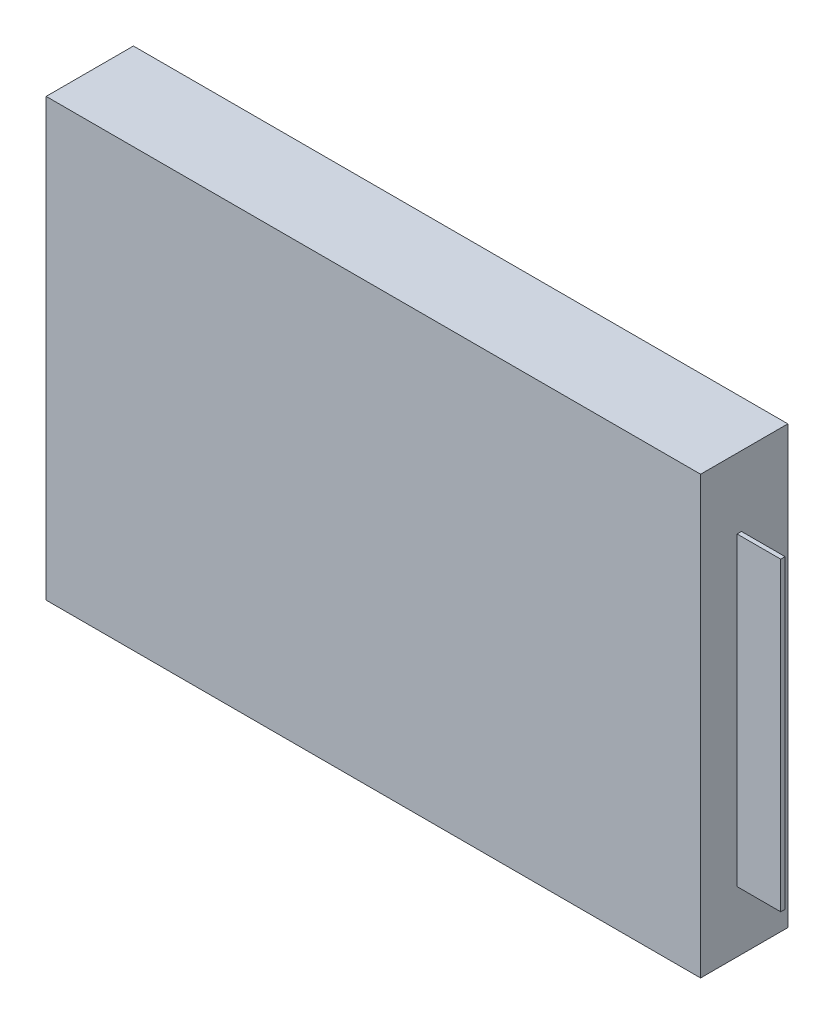
ISO-10303-21;
HEADER;
FILE_DESCRIPTION(('STEP AP214'),'2;1');
FILE_NAME('part.step','',(''),(''),'','','');
FILE_SCHEMA(('AUTOMOTIVE_DESIGN { 1 0 10303 214 1 1 1 1 }'));
ENDSEC;
DATA;
#1=APPLICATION_CONTEXT('core data for automotive mechanical design processes');
#2=APPLICATION_PROTOCOL_DEFINITION('international standard','automotive_design',2000,#1);
#3=PRODUCT_CONTEXT('',#1,'mechanical');
#4=PRODUCT('Part','Part','',(#3));
#5=PRODUCT_RELATED_PRODUCT_CATEGORY('part','',(#4));
#6=PRODUCT_DEFINITION_FORMATION('','',#4);
#7=PRODUCT_DEFINITION_CONTEXT('part definition',#1,'design');
#8=PRODUCT_DEFINITION('design','',#6,#7);
#9=PRODUCT_DEFINITION_SHAPE('','',#8);
#10=(LENGTH_UNIT() NAMED_UNIT(*) SI_UNIT(.MILLI.,.METRE.));
#11=(NAMED_UNIT(*) PLANE_ANGLE_UNIT() SI_UNIT($,.RADIAN.));
#12=(NAMED_UNIT(*) SI_UNIT($,.STERADIAN.) SOLID_ANGLE_UNIT());
#13=UNCERTAINTY_MEASURE_WITH_UNIT(LENGTH_MEASURE(1.E-05),#10,'distance_accuracy_value','');
#14=(GEOMETRIC_REPRESENTATION_CONTEXT(3) GLOBAL_UNCERTAINTY_ASSIGNED_CONTEXT((#13)) GLOBAL_UNIT_ASSIGNED_CONTEXT((#10,
#11,#12)) REPRESENTATION_CONTEXT('',''));
#15=CARTESIAN_POINT('',(0.,0.,0.));
#16=DIRECTION('',(0.,0.,1.));
#17=DIRECTION('',(1.,0.,0.));
#18=AXIS2_PLACEMENT_3D('',#15,#16,#17);
#19=CARTESIAN_POINT('',(15.,-10.,4.));
#20=DIRECTION('',(-1.,0.,0.));
#21=DIRECTION('',(0.,0.,1.));
#22=AXIS2_PLACEMENT_3D('',#19,#20,#21);
#23=PLANE('',#22);
#24=DIRECTION('',(0.,1.,0.));
#25=VECTOR('',#24,1.);
#26=CARTESIAN_POINT('',(15.,-10.,0.));
#27=LINE('',#26,#25);
#28=CARTESIAN_POINT('',(15.,-10.,0.));
#29=VERTEX_POINT('',#28);
#30=CARTESIAN_POINT('',(15.,10.,0.));
#31=VERTEX_POINT('',#30);
#32=EDGE_CURVE('E131',#29,#31,#27,.T.);
#33=ORIENTED_EDGE('',*,*,#32,.T.);
#34=DIRECTION('',(0.,0.,-1.));
#35=VECTOR('',#34,1.);
#36=CARTESIAN_POINT('',(15.,10.,4.));
#37=LINE('',#36,#35);
#38=CARTESIAN_POINT('',(15.,10.,4.));
#39=VERTEX_POINT('',#38);
#40=EDGE_CURVE('E11',#39,#31,#37,.T.);
#41=ORIENTED_EDGE('',*,*,#40,.F.);
#42=DIRECTION('',(0.,1.,0.));
#43=VECTOR('',#42,1.);
#44=CARTESIAN_POINT('',(15.,-10.,4.));
#45=LINE('',#44,#43);
#46=CARTESIAN_POINT('',(15.,-10.,4.));
#47=VERTEX_POINT('',#46);
#48=EDGE_CURVE('E140',#47,#39,#45,.T.);
#49=ORIENTED_EDGE('',*,*,#48,.F.);
#50=DIRECTION('',(0.,0.,-1.));
#51=VECTOR('',#50,1.);
#52=CARTESIAN_POINT('',(15.,-10.,4.));
#53=LINE('',#52,#51);
#54=EDGE_CURVE('E145',#47,#29,#53,.T.);
#55=ORIENTED_EDGE('',*,*,#54,.T.);
#56=EDGE_LOOP('',(#33,#41,#49,#55));
#57=FACE_BOUND('',#56,.T.);
#58=DIRECTION('',(0.,0.,-1.));
#59=VECTOR('',#58,1.);
#60=CARTESIAN_POINT('',(15.,-7.20985203650736,2.32541441581846));
#61=LINE('',#60,#59);
#62=CARTESIAN_POINT('',(15.,-7.20985203650736,2.32541441581846));
#63=VERTEX_POINT('',#62);
#64=CARTESIAN_POINT('',(15.,-7.20985203650736,2.12541441581846));
#65=VERTEX_POINT('',#64);
#66=EDGE_CURVE('E129',#63,#65,#61,.T.);
#67=ORIENTED_EDGE('',*,*,#66,.F.);
#68=DIRECTION('',(0.,1.,0.));
#69=VECTOR('',#68,1.);
#70=CARTESIAN_POINT('',(15.,-7.20985203650736,2.32541441581846));
#71=LINE('',#70,#69);
#72=CARTESIAN_POINT('',(15.,6.79014796349264,2.32541441581846));
#73=VERTEX_POINT('',#72);
#74=EDGE_CURVE('E125',#63,#73,#71,.T.);
#75=ORIENTED_EDGE('',*,*,#74,.T.);
#76=DIRECTION('',(0.,0.,-1.));
#77=VECTOR('',#76,1.);
#78=CARTESIAN_POINT('',(15.,6.79014796349264,2.32541441581846));
#79=LINE('',#78,#77);
#80=CARTESIAN_POINT('',(15.,6.79014796349264,2.12541441581846));
#81=VERTEX_POINT('',#80);
#82=EDGE_CURVE('E47',#73,#81,#79,.T.);
#83=ORIENTED_EDGE('',*,*,#82,.T.);
#84=DIRECTION('',(0.,1.,0.));
#85=VECTOR('',#84,1.);
#86=CARTESIAN_POINT('',(15.,-7.20985203650736,2.12541441581846));
#87=LINE('',#86,#85);
#88=EDGE_CURVE('E260',#65,#81,#87,.T.);
#89=ORIENTED_EDGE('',*,*,#88,.F.);
#90=EDGE_LOOP('',(#67,#75,#83,#89));
#91=FACE_BOUND('',#90,.T.);
#92=ADVANCED_FACE('F33',(#57,#91),#23,.F.);
#93=CARTESIAN_POINT('',(-15.,10.,4.));
#94=DIRECTION('',(0.,-1.,0.));
#95=DIRECTION('',(0.,0.,-1.));
#96=AXIS2_PLACEMENT_3D('',#93,#94,#95);
#97=PLANE('',#96);
#98=DIRECTION('',(-1.,0.,0.));
#99=VECTOR('',#98,1.);
#100=CARTESIAN_POINT('',(-15.,10.,0.));
#101=LINE('',#100,#99);
#102=CARTESIAN_POINT('',(-15.,10.,0.));
#103=VERTEX_POINT('',#102);
#104=EDGE_CURVE('E134',#31,#103,#101,.T.);
#105=ORIENTED_EDGE('',*,*,#104,.T.);
#106=DIRECTION('',(0.,0.,-1.));
#107=VECTOR('',#106,1.);
#108=CARTESIAN_POINT('',(-15.,10.,4.));
#109=LINE('',#108,#107);
#110=CARTESIAN_POINT('',(-15.,10.,4.));
#111=VERTEX_POINT('',#110);
#112=EDGE_CURVE('E40',#111,#103,#109,.T.);
#113=ORIENTED_EDGE('',*,*,#112,.F.);
#114=DIRECTION('',(-1.,0.,0.));
#115=VECTOR('',#114,1.);
#116=CARTESIAN_POINT('',(-15.,10.,4.));
#117=LINE('',#116,#115);
#118=EDGE_CURVE('E84',#39,#111,#117,.T.);
#119=ORIENTED_EDGE('',*,*,#118,.F.);
#120=ORIENTED_EDGE('',*,*,#40,.T.);
#121=EDGE_LOOP('',(#105,#113,#119,#120));
#122=FACE_BOUND('',#121,.T.);
#123=ADVANCED_FACE('F175',(#122),#97,.F.);
#124=CARTESIAN_POINT('',(-15.,-10.,4.));
#125=DIRECTION('',(1.,0.,0.));
#126=DIRECTION('',(0.,0.,-1.));
#127=AXIS2_PLACEMENT_3D('',#124,#125,#126);
#128=PLANE('',#127);
#129=DIRECTION('',(0.,-1.,0.));
#130=VECTOR('',#129,1.);
#131=CARTESIAN_POINT('',(-15.,-10.,0.));
#132=LINE('',#131,#130);
#133=CARTESIAN_POINT('',(-15.,-10.,0.));
#134=VERTEX_POINT('',#133);
#135=EDGE_CURVE('E148',#103,#134,#132,.T.);
#136=ORIENTED_EDGE('',*,*,#135,.T.);
#137=DIRECTION('',(0.,0.,-1.));
#138=VECTOR('',#137,1.);
#139=CARTESIAN_POINT('',(-15.,-10.,4.));
#140=LINE('',#139,#138);
#141=CARTESIAN_POINT('',(-15.,-10.,4.));
#142=VERTEX_POINT('',#141);
#143=EDGE_CURVE('E152',#142,#134,#140,.T.);
#144=ORIENTED_EDGE('',*,*,#143,.F.);
#145=DIRECTION('',(0.,-1.,0.));
#146=VECTOR('',#145,1.);
#147=CARTESIAN_POINT('',(-15.,-10.,4.));
#148=LINE('',#147,#146);
#149=EDGE_CURVE('E143',#111,#142,#148,.T.);
#150=ORIENTED_EDGE('',*,*,#149,.F.);
#151=ORIENTED_EDGE('',*,*,#112,.T.);
#152=EDGE_LOOP('',(#136,#144,#150,#151));
#153=FACE_BOUND('',#152,.T.);
#154=ADVANCED_FACE('F157',(#153),#128,.F.);
#155=CARTESIAN_POINT('',(-15.,-10.,4.));
#156=DIRECTION('',(0.,1.,0.));
#157=DIRECTION('',(0.,0.,1.));
#158=AXIS2_PLACEMENT_3D('',#155,#156,#157);
#159=PLANE('',#158);
#160=DIRECTION('',(1.,0.,0.));
#161=VECTOR('',#160,1.);
#162=CARTESIAN_POINT('',(-15.,-10.,0.));
#163=LINE('',#162,#161);
#164=EDGE_CURVE('E77',#134,#29,#163,.T.);
#165=ORIENTED_EDGE('',*,*,#164,.T.);
#166=ORIENTED_EDGE('',*,*,#54,.F.);
#167=DIRECTION('',(1.,0.,0.));
#168=VECTOR('',#167,1.);
#169=CARTESIAN_POINT('',(-15.,-10.,4.));
#170=LINE('',#169,#168);
#171=EDGE_CURVE('E56',#142,#47,#170,.T.);
#172=ORIENTED_EDGE('',*,*,#171,.F.);
#173=ORIENTED_EDGE('',*,*,#143,.T.);
#174=EDGE_LOOP('',(#165,#166,#172,#173));
#175=FACE_BOUND('',#174,.T.);
#176=ADVANCED_FACE('F166',(#175),#159,.F.);
#177=CARTESIAN_POINT('',(0.,0.,4.));
#178=DIRECTION('',(0.,0.,-1.));
#179=DIRECTION('',(-1.,0.,0.));
#180=AXIS2_PLACEMENT_3D('',#177,#178,#179);
#181=PLANE('',#180);
#182=ORIENTED_EDGE('',*,*,#48,.T.);
#183=ORIENTED_EDGE('',*,*,#118,.T.);
#184=ORIENTED_EDGE('',*,*,#149,.T.);
#185=ORIENTED_EDGE('',*,*,#171,.T.);
#186=EDGE_LOOP('',(#182,#183,#184,#185));
#187=FACE_BOUND('',#186,.T.);
#188=ADVANCED_FACE('F168',(#187),#181,.F.);
#189=CARTESIAN_POINT('',(0.,0.,0.));
#190=DIRECTION('',(0.,0.,-1.));
#191=DIRECTION('',(-1.,0.,0.));
#192=AXIS2_PLACEMENT_3D('',#189,#190,#191);
#193=PLANE('',#192);
#194=ORIENTED_EDGE('',*,*,#32,.F.);
#195=ORIENTED_EDGE('',*,*,#164,.F.);
#196=ORIENTED_EDGE('',*,*,#135,.F.);
#197=ORIENTED_EDGE('',*,*,#104,.F.);
#198=EDGE_LOOP('',(#194,#195,#196,#197));
#199=FACE_BOUND('',#198,.T.);
#200=ADVANCED_FACE('F161',(#199),#193,.T.);
#201=CARTESIAN_POINT('',(17.,-7.20985203650736,2.32541441581846));
#202=DIRECTION('',(0.,1.,0.));
#203=DIRECTION('',(0.,0.,1.));
#204=AXIS2_PLACEMENT_3D('',#201,#202,#203);
#205=PLANE('',#204);
#206=ORIENTED_EDGE('',*,*,#66,.T.);
#207=DIRECTION('',(-1.,0.,0.));
#208=VECTOR('',#207,1.);
#209=CARTESIAN_POINT('',(17.,-7.20985203650736,2.12541441581846));
#210=LINE('',#209,#208);
#211=CARTESIAN_POINT('',(17.,-7.20985203650736,2.12541441581846));
#212=VERTEX_POINT('',#211);
#213=EDGE_CURVE('E110',#212,#65,#210,.T.);
#214=ORIENTED_EDGE('',*,*,#213,.F.);
#215=DIRECTION('',(0.,0.,-1.));
#216=VECTOR('',#215,1.);
#217=CARTESIAN_POINT('',(17.,-7.20985203650736,2.32541441581846));
#218=LINE('',#217,#216);
#219=CARTESIAN_POINT('',(17.,-7.20985203650736,2.32541441581846));
#220=VERTEX_POINT('',#219);
#221=EDGE_CURVE('E117',#220,#212,#218,.T.);
#222=ORIENTED_EDGE('',*,*,#221,.F.);
#223=DIRECTION('',(-1.,0.,0.));
#224=VECTOR('',#223,1.);
#225=CARTESIAN_POINT('',(17.,-7.20985203650736,2.32541441581846));
#226=LINE('',#225,#224);
#227=EDGE_CURVE('E258',#220,#63,#226,.T.);
#228=ORIENTED_EDGE('',*,*,#227,.T.);
#229=EDGE_LOOP('',(#206,#214,#222,#228));
#230=FACE_BOUND('',#229,.T.);
#231=ADVANCED_FACE('F127',(#230),#205,.F.);
#232=CARTESIAN_POINT('',(17.,-7.20985203650736,2.12541441581846));
#233=DIRECTION('',(0.,0.,1.));
#234=DIRECTION('',(1.,0.,0.));
#235=AXIS2_PLACEMENT_3D('',#232,#233,#234);
#236=PLANE('',#235);
#237=ORIENTED_EDGE('',*,*,#88,.T.);
#238=DIRECTION('',(-1.,0.,0.));
#239=VECTOR('',#238,1.);
#240=CARTESIAN_POINT('',(17.,6.79014796349264,2.12541441581846));
#241=LINE('',#240,#239);
#242=CARTESIAN_POINT('',(17.,6.79014796349264,2.12541441581846));
#243=VERTEX_POINT('',#242);
#244=EDGE_CURVE('E112',#243,#81,#241,.T.);
#245=ORIENTED_EDGE('',*,*,#244,.F.);
#246=DIRECTION('',(0.,1.,0.));
#247=VECTOR('',#246,1.);
#248=CARTESIAN_POINT('',(17.,-7.20985203650736,2.12541441581846));
#249=LINE('',#248,#247);
#250=EDGE_CURVE('E105',#212,#243,#249,.T.);
#251=ORIENTED_EDGE('',*,*,#250,.F.);
#252=ORIENTED_EDGE('',*,*,#213,.T.);
#253=EDGE_LOOP('',(#237,#245,#251,#252));
#254=FACE_BOUND('',#253,.T.);
#255=ADVANCED_FACE('F108',(#254),#236,.F.);
#256=CARTESIAN_POINT('',(17.,6.79014796349264,2.32541441581846));
#257=DIRECTION('',(0.,1.,0.));
#258=DIRECTION('',(0.,0.,1.));
#259=AXIS2_PLACEMENT_3D('',#256,#257,#258);
#260=PLANE('',#259);
#261=ORIENTED_EDGE('',*,*,#82,.F.);
#262=DIRECTION('',(-1.,0.,0.));
#263=VECTOR('',#262,1.);
#264=CARTESIAN_POINT('',(17.,6.79014796349264,2.32541441581846));
#265=LINE('',#264,#263);
#266=CARTESIAN_POINT('',(17.,6.79014796349264,2.32541441581846));
#267=VERTEX_POINT('',#266);
#268=EDGE_CURVE('E136',#267,#73,#265,.T.);
#269=ORIENTED_EDGE('',*,*,#268,.F.);
#270=DIRECTION('',(0.,0.,-1.));
#271=VECTOR('',#270,1.);
#272=CARTESIAN_POINT('',(17.,6.79014796349264,2.32541441581846));
#273=LINE('',#272,#271);
#274=EDGE_CURVE('E116',#267,#243,#273,.T.);
#275=ORIENTED_EDGE('',*,*,#274,.T.);
#276=ORIENTED_EDGE('',*,*,#244,.T.);
#277=EDGE_LOOP('',(#261,#269,#275,#276));
#278=FACE_BOUND('',#277,.T.);
#279=ADVANCED_FACE('F226',(#278),#260,.T.);
#280=CARTESIAN_POINT('',(17.,-7.20985203650736,2.32541441581846));
#281=DIRECTION('',(0.,0.,1.));
#282=DIRECTION('',(1.,0.,0.));
#283=AXIS2_PLACEMENT_3D('',#280,#281,#282);
#284=PLANE('',#283);
#285=ORIENTED_EDGE('',*,*,#74,.F.);
#286=ORIENTED_EDGE('',*,*,#227,.F.);
#287=DIRECTION('',(0.,1.,0.));
#288=VECTOR('',#287,1.);
#289=CARTESIAN_POINT('',(17.,-7.20985203650736,2.32541441581846));
#290=LINE('',#289,#288);
#291=EDGE_CURVE('E123',#220,#267,#290,.T.);
#292=ORIENTED_EDGE('',*,*,#291,.T.);
#293=ORIENTED_EDGE('',*,*,#268,.T.);
#294=EDGE_LOOP('',(#285,#286,#292,#293));
#295=FACE_BOUND('',#294,.T.);
#296=ADVANCED_FACE('F235',(#295),#284,.T.);
#297=CARTESIAN_POINT('',(17.,0.,0.));
#298=DIRECTION('',(1.,0.,0.));
#299=DIRECTION('',(0.,0.,-1.));
#300=AXIS2_PLACEMENT_3D('',#297,#298,#299);
#301=PLANE('',#300);
#302=ORIENTED_EDGE('',*,*,#221,.T.);
#303=ORIENTED_EDGE('',*,*,#250,.T.);
#304=ORIENTED_EDGE('',*,*,#274,.F.);
#305=ORIENTED_EDGE('',*,*,#291,.F.);
#306=EDGE_LOOP('',(#302,#303,#304,#305));
#307=FACE_BOUND('',#306,.T.);
#308=ADVANCED_FACE('F121',(#307),#301,.T.);
#309=CLOSED_SHELL('',(#92,#123,#154,#176,#188,#200,#231,#255,#279,#296,#308));
#310=MANIFOLD_SOLID_BREP('B2',#309);
#311=ADVANCED_BREP_SHAPE_REPRESENTATION('',(#18,#310),#14);
#312=SHAPE_DEFINITION_REPRESENTATION(#9,#311);
ENDSEC;
END-ISO-10303-21;
